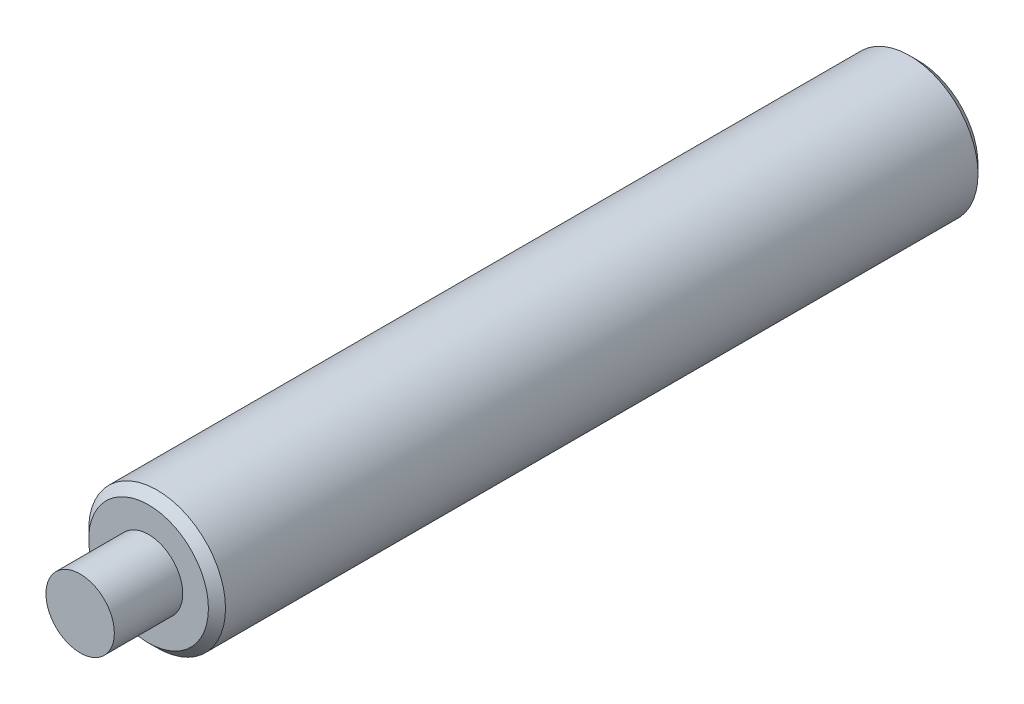
ISO-10303-21;
HEADER;
FILE_DESCRIPTION(('STEP AP214'),'2;1');
FILE_NAME('part.step','',(''),(''),'','','');
FILE_SCHEMA(('AUTOMOTIVE_DESIGN { 1 0 10303 214 1 1 1 1 }'));
ENDSEC;
DATA;
#1=APPLICATION_CONTEXT('core data for automotive mechanical design processes');
#2=APPLICATION_PROTOCOL_DEFINITION('international standard','automotive_design',2000,#1);
#3=PRODUCT_CONTEXT('',#1,'mechanical');
#4=PRODUCT('Part','Part','',(#3));
#5=PRODUCT_RELATED_PRODUCT_CATEGORY('part','',(#4));
#6=PRODUCT_DEFINITION_FORMATION('','',#4);
#7=PRODUCT_DEFINITION_CONTEXT('part definition',#1,'design');
#8=PRODUCT_DEFINITION('design','',#6,#7);
#9=PRODUCT_DEFINITION_SHAPE('','',#8);
#10=(LENGTH_UNIT() NAMED_UNIT(*) SI_UNIT(.MILLI.,.METRE.));
#11=(NAMED_UNIT(*) PLANE_ANGLE_UNIT() SI_UNIT($,.RADIAN.));
#12=(NAMED_UNIT(*) SI_UNIT($,.STERADIAN.) SOLID_ANGLE_UNIT());
#13=UNCERTAINTY_MEASURE_WITH_UNIT(LENGTH_MEASURE(1.E-05),#10,'distance_accuracy_value','');
#14=(GEOMETRIC_REPRESENTATION_CONTEXT(3) GLOBAL_UNCERTAINTY_ASSIGNED_CONTEXT((#13)) GLOBAL_UNIT_ASSIGNED_CONTEXT((#10,
#11,#12)) REPRESENTATION_CONTEXT('',''));
#15=CARTESIAN_POINT('',(0.,0.,0.));
#16=DIRECTION('',(0.,0.,1.));
#17=DIRECTION('',(1.,0.,0.));
#18=AXIS2_PLACEMENT_3D('',#15,#16,#17);
#19=CARTESIAN_POINT('',(0.,0.,45.));
#20=DIRECTION('',(0.,0.,1.));
#21=DIRECTION('',(1.,0.,0.));
#22=AXIS2_PLACEMENT_3D('',#19,#20,#21);
#23=PLANE('',#22);
#24=CARTESIAN_POINT('',(0.,0.,45.));
#25=DIRECTION('',(0.,0.,1.));
#26=DIRECTION('',(1.,0.,0.));
#27=AXIS2_PLACEMENT_3D('',#24,#25,#26);
#28=CIRCLE('',#27,3.49999999999999);
#29=CARTESIAN_POINT('',(3.49999999999999,0.,45.));
#30=VERTEX_POINT('',#29);
#31=EDGE_CURVE('E10',#30,#30,#28,.T.);
#32=ORIENTED_EDGE('',*,*,#31,.T.);
#33=EDGE_LOOP('',(#32));
#34=FACE_BOUND('',#33,.T.);
#35=CARTESIAN_POINT('',(0.,0.,45.));
#36=DIRECTION('',(0.,0.,1.));
#37=DIRECTION('',(1.,0.,0.));
#38=AXIS2_PLACEMENT_3D('',#35,#36,#37);
#39=CIRCLE('',#38,2.);
#40=CARTESIAN_POINT('',(2.,0.,45.));
#41=VERTEX_POINT('',#40);
#42=EDGE_CURVE('E53',#41,#41,#39,.T.);
#43=ORIENTED_EDGE('',*,*,#42,.F.);
#44=EDGE_LOOP('',(#43));
#45=FACE_BOUND('',#44,.T.);
#46=ADVANCED_FACE('F30',(#34,#45),#23,.T.);
#47=CARTESIAN_POINT('',(0.,0.,45.));
#48=DIRECTION('',(0.,0.,-1.));
#49=DIRECTION('',(-1.,0.,0.));
#50=AXIS2_PLACEMENT_3D('',#47,#48,#49);
#51=CYLINDRICAL_SURFACE('',#50,4.);
#52=CARTESIAN_POINT('',(0.,0.,0.5));
#53=DIRECTION('',(0.,0.,1.));
#54=DIRECTION('',(1.,0.,0.));
#55=AXIS2_PLACEMENT_3D('',#52,#53,#54);
#56=CIRCLE('',#55,4.);
#57=CARTESIAN_POINT('',(4.,0.,0.5));
#58=VERTEX_POINT('',#57);
#59=EDGE_CURVE('E41',#58,#58,#56,.T.);
#60=ORIENTED_EDGE('',*,*,#59,.T.);
#61=EDGE_LOOP('',(#60));
#62=FACE_BOUND('',#61,.T.);
#63=CARTESIAN_POINT('',(0.,0.,44.5));
#64=DIRECTION('',(0.,0.,1.));
#65=DIRECTION('',(1.,0.,0.));
#66=AXIS2_PLACEMENT_3D('',#63,#64,#65);
#67=CIRCLE('',#66,4.);
#68=CARTESIAN_POINT('',(4.,0.,44.5));
#69=VERTEX_POINT('',#68);
#70=EDGE_CURVE('E45',#69,#69,#67,.F.);
#71=ORIENTED_EDGE('',*,*,#70,.T.);
#72=EDGE_LOOP('',(#71));
#73=FACE_BOUND('',#72,.T.);
#74=ADVANCED_FACE('F32',(#62,#73),#51,.T.);
#75=CARTESIAN_POINT('',(0.,0.,0.));
#76=DIRECTION('',(0.,0.,1.));
#77=DIRECTION('',(1.,0.,0.));
#78=AXIS2_PLACEMENT_3D('',#75,#76,#77);
#79=PLANE('',#78);
#80=CARTESIAN_POINT('',(0.,0.,0.));
#81=DIRECTION('',(0.,0.,1.));
#82=DIRECTION('',(1.,0.,0.));
#83=AXIS2_PLACEMENT_3D('',#80,#81,#82);
#84=CIRCLE('',#83,3.49999999999999);
#85=CARTESIAN_POINT('',(3.49999999999999,0.,0.));
#86=VERTEX_POINT('',#85);
#87=EDGE_CURVE('E37',#86,#86,#84,.F.);
#88=ORIENTED_EDGE('',*,*,#87,.T.);
#89=EDGE_LOOP('',(#88));
#90=FACE_BOUND('',#89,.T.);
#91=ADVANCED_FACE('F63',(#90),#79,.F.);
#92=CARTESIAN_POINT('',(0.,0.,49.));
#93=DIRECTION('',(0.,0.,-1.));
#94=DIRECTION('',(-1.,0.,0.));
#95=AXIS2_PLACEMENT_3D('',#92,#93,#94);
#96=CYLINDRICAL_SURFACE('',#95,2.);
#97=CARTESIAN_POINT('',(0.,0.,49.));
#98=DIRECTION('',(0.,0.,1.));
#99=DIRECTION('',(1.,0.,0.));
#100=AXIS2_PLACEMENT_3D('',#97,#98,#99);
#101=CIRCLE('',#100,2.);
#102=CARTESIAN_POINT('',(2.,0.,49.));
#103=VERTEX_POINT('',#102);
#104=EDGE_CURVE('E50',#103,#103,#101,.T.);
#105=ORIENTED_EDGE('',*,*,#104,.F.);
#106=EDGE_LOOP('',(#105));
#107=FACE_BOUND('',#106,.T.);
#108=ORIENTED_EDGE('',*,*,#42,.T.);
#109=EDGE_LOOP('',(#108));
#110=FACE_BOUND('',#109,.T.);
#111=ADVANCED_FACE('F57',(#107,#110),#96,.T.);
#112=CARTESIAN_POINT('',(0.,0.,49.));
#113=DIRECTION('',(0.,0.,1.));
#114=DIRECTION('',(1.,0.,0.));
#115=AXIS2_PLACEMENT_3D('',#112,#113,#114);
#116=PLANE('',#115);
#117=ORIENTED_EDGE('',*,*,#104,.T.);
#118=EDGE_LOOP('',(#117));
#119=FACE_BOUND('',#118,.T.);
#120=ADVANCED_FACE('F70',(#119),#116,.T.);
#121=CARTESIAN_POINT('',(0.,0.,0.5));
#122=DIRECTION('',(0.,0.,1.));
#123=DIRECTION('',(1.,0.,0.));
#124=AXIS2_PLACEMENT_3D('',#121,#122,#123);
#125=CONICAL_SURFACE('',#124,4.,0.785398163397457);
#126=ORIENTED_EDGE('',*,*,#87,.F.);
#127=EDGE_LOOP('',(#126));
#128=FACE_BOUND('',#127,.T.);
#129=ORIENTED_EDGE('',*,*,#59,.F.);
#130=EDGE_LOOP('',(#129));
#131=FACE_BOUND('',#130,.T.);
#132=ADVANCED_FACE('F74',(#128,#131),#125,.T.);
#133=CARTESIAN_POINT('',(0.,0.,45.));
#134=DIRECTION('',(0.,0.,-1.));
#135=DIRECTION('',(-1.,0.,0.));
#136=AXIS2_PLACEMENT_3D('',#133,#134,#135);
#137=CONICAL_SURFACE('',#136,3.49999999999999,0.785398163397457);
#138=ORIENTED_EDGE('',*,*,#70,.F.);
#139=EDGE_LOOP('',(#138));
#140=FACE_BOUND('',#139,.T.);
#141=ORIENTED_EDGE('',*,*,#31,.F.);
#142=EDGE_LOOP('',(#141));
#143=FACE_BOUND('',#142,.T.);
#144=ADVANCED_FACE('F78',(#140,#143),#137,.T.);
#145=CLOSED_SHELL('',(#46,#74,#91,#111,#120,#132,#144));
#146=MANIFOLD_SOLID_BREP('B2',#145);
#147=ADVANCED_BREP_SHAPE_REPRESENTATION('',(#18,#146),#14);
#148=SHAPE_DEFINITION_REPRESENTATION(#9,#147);
ENDSEC;
END-ISO-10303-21;
